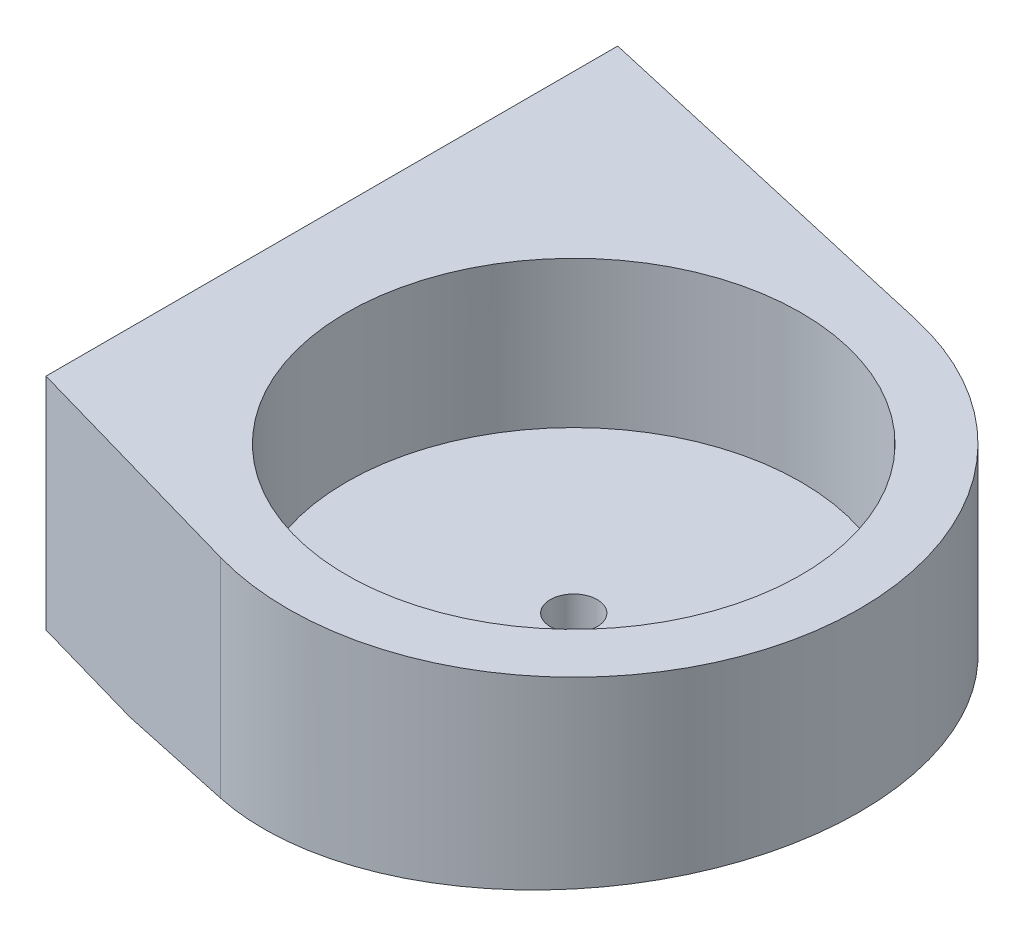
ISO-10303-21;
HEADER;
FILE_DESCRIPTION(('STEP AP214'),'2;1');
FILE_NAME('part.step','',(''),(''),'','','');
FILE_SCHEMA(('AUTOMOTIVE_DESIGN { 1 0 10303 214 1 1 1 1 }'));
ENDSEC;
DATA;
#1=APPLICATION_CONTEXT('core data for automotive mechanical design processes');
#2=APPLICATION_PROTOCOL_DEFINITION('international standard','automotive_design',2000,#1);
#3=PRODUCT_CONTEXT('',#1,'mechanical');
#4=PRODUCT('Part','Part','',(#3));
#5=PRODUCT_RELATED_PRODUCT_CATEGORY('part','',(#4));
#6=PRODUCT_DEFINITION_FORMATION('','',#4);
#7=PRODUCT_DEFINITION_CONTEXT('part definition',#1,'design');
#8=PRODUCT_DEFINITION('design','',#6,#7);
#9=PRODUCT_DEFINITION_SHAPE('','',#8);
#10=(LENGTH_UNIT() NAMED_UNIT(*) SI_UNIT(.MILLI.,.METRE.));
#11=(NAMED_UNIT(*) PLANE_ANGLE_UNIT() SI_UNIT($,.RADIAN.));
#12=(NAMED_UNIT(*) SI_UNIT($,.STERADIAN.) SOLID_ANGLE_UNIT());
#13=UNCERTAINTY_MEASURE_WITH_UNIT(LENGTH_MEASURE(1.E-05),#10,'distance_accuracy_value','');
#14=(GEOMETRIC_REPRESENTATION_CONTEXT(3) GLOBAL_UNCERTAINTY_ASSIGNED_CONTEXT((#13)) GLOBAL_UNIT_ASSIGNED_CONTEXT((#10,
#11,#12)) REPRESENTATION_CONTEXT('',''));
#15=CARTESIAN_POINT('',(0.,0.,0.));
#16=DIRECTION('',(0.,0.,1.));
#17=DIRECTION('',(1.,0.,0.));
#18=AXIS2_PLACEMENT_3D('',#15,#16,#17);
#19=CARTESIAN_POINT('',(4.32348319389158,15.,-19.0146652106246));
#20=DIRECTION('',(0.221717086866235,0.,-0.975111036442287));
#21=DIRECTION('',(-0.975111036442287,0.,-0.221717086866235));
#22=AXIS2_PLACEMENT_3D('',#19,#20,#21);
#23=PLANE('',#22);
#24=DIRECTION('',(0.,-1.,0.));
#25=VECTOR('',#24,1.);
#26=CARTESIAN_POINT('',(4.32348319389158,15.,-19.0146652106246));
#27=LINE('',#26,#25);
#28=CARTESIAN_POINT('',(4.32348319389158,15.,-19.0146652106246));
#29=VERTEX_POINT('',#28);
#30=CARTESIAN_POINT('',(4.32348319389158,1.64090894273656,-19.0146652106246));
#31=VERTEX_POINT('',#30);
#32=EDGE_CURVE('E78',#29,#31,#27,.T.);
#33=ORIENTED_EDGE('',*,*,#32,.T.);
#34=DIRECTION('',(-0.971414372160437,-0.086992331835263,-0.220876553219231));
#35=VECTOR('',#34,1.);
#36=CARTESIAN_POINT('',(5.4524012180103,1.7420060792248,-18.7579760682972));
#37=LINE('',#36,#35);
#38=CARTESIAN_POINT('',(-14.,0.,-23.1809900322722));
#39=VERTEX_POINT('',#38);
#40=EDGE_CURVE('E89',#31,#39,#37,.T.);
#41=ORIENTED_EDGE('',*,*,#40,.T.);
#42=DIRECTION('',(0.975111036442287,0.,0.221717086866235));
#43=VECTOR('',#42,1.);
#44=CARTESIAN_POINT('',(4.32348319389158,0.,-19.0146652106246));
#45=LINE('',#44,#43);
#46=CARTESIAN_POINT('',(-22.,0.,-25.));
#47=VERTEX_POINT('',#46);
#48=EDGE_CURVE('E93',#47,#39,#45,.T.);
#49=ORIENTED_EDGE('',*,*,#48,.F.);
#50=DIRECTION('',(0.,-1.,0.));
#51=VECTOR('',#50,1.);
#52=CARTESIAN_POINT('',(-22.,15.,-25.));
#53=LINE('',#52,#51);
#54=CARTESIAN_POINT('',(-22.,15.,-25.));
#55=VERTEX_POINT('',#54);
#56=EDGE_CURVE('E57',#55,#47,#53,.T.);
#57=ORIENTED_EDGE('',*,*,#56,.F.);
#58=DIRECTION('',(0.975111036442287,0.,0.221717086866235));
#59=VECTOR('',#58,1.);
#60=CARTESIAN_POINT('',(4.32348319389158,15.,-19.0146652106246));
#61=LINE('',#60,#59);
#62=EDGE_CURVE('E127',#55,#29,#61,.T.);
#63=ORIENTED_EDGE('',*,*,#62,.T.);
#64=EDGE_LOOP('',(#33,#41,#49,#57,#63));
#65=FACE_BOUND('',#64,.T.);
#66=ADVANCED_FACE('F34',(#65),#23,.T.);
#67=CARTESIAN_POINT('',(-5.3514292849436,15.,18.7513254093744));
#68=DIRECTION('',(-0.274432271022749,0.,0.961606431249966));
#69=DIRECTION('',(0.961606431249966,0.,0.274432271022749));
#70=AXIS2_PLACEMENT_3D('',#67,#68,#69);
#71=PLANE('',#70);
#72=DIRECTION('',(-0.961606431249966,0.,-0.274432271022749));
#73=VECTOR('',#72,1.);
#74=CARTESIAN_POINT('',(-5.3514292849436,0.,18.7513254093744));
#75=LINE('',#74,#73);
#76=CARTESIAN_POINT('',(-14.,0.,16.2831151049273));
#77=VERTEX_POINT('',#76);
#78=CARTESIAN_POINT('',(-22.,0.,14.));
#79=VERTEX_POINT('',#78);
#80=EDGE_CURVE('E97',#77,#79,#75,.T.);
#81=ORIENTED_EDGE('',*,*,#80,.F.);
#82=DIRECTION('',(0.958060684401584,0.0857964792001418,0.273420352499275));
#83=VECTOR('',#82,1.);
#84=CARTESIAN_POINT('',(-4.18211822024306,0.879213293709578,19.0850343786464));
#85=LINE('',#84,#83);
#86=CARTESIAN_POINT('',(-5.3514292849436,0.774498870005053,18.7513254093744));
#87=VERTEX_POINT('',#86);
#88=EDGE_CURVE('E48',#77,#87,#85,.T.);
#89=ORIENTED_EDGE('',*,*,#88,.T.);
#90=DIRECTION('',(0.,-1.,0.));
#91=VECTOR('',#90,1.);
#92=CARTESIAN_POINT('',(-5.3514292849436,15.,18.7513254093744));
#93=LINE('',#92,#91);
#94=CARTESIAN_POINT('',(-5.3514292849436,15.,18.7513254093744));
#95=VERTEX_POINT('',#94);
#96=EDGE_CURVE('E110',#95,#87,#93,.T.);
#97=ORIENTED_EDGE('',*,*,#96,.F.);
#98=DIRECTION('',(-0.961606431249966,0.,-0.274432271022749));
#99=VECTOR('',#98,1.);
#100=CARTESIAN_POINT('',(-5.3514292849436,15.,18.7513254093744));
#101=LINE('',#100,#99);
#102=CARTESIAN_POINT('',(-22.,15.,14.));
#103=VERTEX_POINT('',#102);
#104=EDGE_CURVE('E133',#95,#103,#101,.T.);
#105=ORIENTED_EDGE('',*,*,#104,.T.);
#106=DIRECTION('',(0.,-1.,0.));
#107=VECTOR('',#106,1.);
#108=CARTESIAN_POINT('',(-22.,15.,14.));
#109=LINE('',#108,#107);
#110=EDGE_CURVE('E107',#103,#79,#109,.T.);
#111=ORIENTED_EDGE('',*,*,#110,.T.);
#112=EDGE_LOOP('',(#81,#89,#97,#105,#111));
#113=FACE_BOUND('',#112,.T.);
#114=ADVANCED_FACE('F141',(#113),#71,.T.);
#115=CARTESIAN_POINT('',(0.,15.,0.));
#116=DIRECTION('',(0.,-1.,0.));
#117=DIRECTION('',(0.,0.,-1.));
#118=AXIS2_PLACEMENT_3D('',#115,#116,#117);
#119=CYLINDRICAL_SURFACE('',#118,19.5);
#120=ORIENTED_EDGE('',*,*,#96,.T.);
#121=CARTESIAN_POINT('',(0.,1.25373134328358,0.));
#122=DIRECTION('',(0.0891952975496599,-0.996014155971203,0.));
#123=DIRECTION('',(-0.996014155971203,-0.0891952975496599,0.));
#124=AXIS2_PLACEMENT_3D('',#121,#122,#123);
#125=ELLIPSE('',#124,19.5780349938759,19.5);
#126=EDGE_CURVE('E140',#87,#31,#125,.F.);
#127=ORIENTED_EDGE('',*,*,#126,.T.);
#128=ORIENTED_EDGE('',*,*,#32,.F.);
#129=CARTESIAN_POINT('',(0.,15.,0.));
#130=DIRECTION('',(0.,-1.,0.));
#131=DIRECTION('',(0.,0.,-1.));
#132=AXIS2_PLACEMENT_3D('',#129,#130,#131);
#133=CIRCLE('',#132,19.5);
#134=EDGE_CURVE('E129',#29,#95,#133,.T.);
#135=ORIENTED_EDGE('',*,*,#134,.T.);
#136=EDGE_LOOP('',(#120,#127,#128,#135));
#137=FACE_BOUND('',#136,.T.);
#138=ADVANCED_FACE('F139',(#137),#119,.T.);
#139=CARTESIAN_POINT('',(0.,0.,0.));
#140=DIRECTION('',(0.,1.,0.));
#141=DIRECTION('',(0.,0.,1.));
#142=AXIS2_PLACEMENT_3D('',#139,#140,#141);
#143=PLANE('',#142);
#144=CARTESIAN_POINT('',(-18.,0.,-5.5));
#145=DIRECTION('',(0.,-1.,0.));
#146=DIRECTION('',(0.,0.,-1.));
#147=AXIS2_PLACEMENT_3D('',#144,#145,#146);
#148=CIRCLE('',#147,2.05);
#149=CARTESIAN_POINT('',(-18.,0.,-7.55));
#150=VERTEX_POINT('',#149);
#151=EDGE_CURVE('E148',#150,#150,#148,.T.);
#152=ORIENTED_EDGE('',*,*,#151,.F.);
#153=EDGE_LOOP('',(#152));
#154=FACE_BOUND('',#153,.T.);
#155=DIRECTION('',(0.,0.,-1.));
#156=VECTOR('',#155,1.);
#157=CARTESIAN_POINT('',(-14.,0.,0.));
#158=LINE('',#157,#156);
#159=EDGE_CURVE('E11',#77,#39,#158,.T.);
#160=ORIENTED_EDGE('',*,*,#159,.F.);
#161=ORIENTED_EDGE('',*,*,#80,.T.);
#162=DIRECTION('',(0.,0.,-1.));
#163=VECTOR('',#162,1.);
#164=CARTESIAN_POINT('',(-22.,0.,0.));
#165=LINE('',#164,#163);
#166=EDGE_CURVE('E96',#79,#47,#165,.T.);
#167=ORIENTED_EDGE('',*,*,#166,.T.);
#168=ORIENTED_EDGE('',*,*,#48,.T.);
#169=EDGE_LOOP('',(#160,#161,#167,#168));
#170=FACE_BOUND('',#169,.T.);
#171=ADVANCED_FACE('F36',(#154,#170),#143,.F.);
#172=CARTESIAN_POINT('',(0.,5.,0.));
#173=DIRECTION('',(0.,1.,0.));
#174=DIRECTION('',(0.,0.,1.));
#175=AXIS2_PLACEMENT_3D('',#172,#173,#174);
#176=PLANE('',#175);
#177=CARTESIAN_POINT('',(0.,5.,0.));
#178=DIRECTION('',(0.,1.,0.));
#179=DIRECTION('',(0.,0.,1.));
#180=AXIS2_PLACEMENT_3D('',#177,#178,#179);
#181=CIRCLE('',#180,1.6);
#182=CARTESIAN_POINT('',(0.,5.,1.6));
#183=VERTEX_POINT('',#182);
#184=EDGE_CURVE('E142',#183,#183,#181,.T.);
#185=ORIENTED_EDGE('',*,*,#184,.F.);
#186=EDGE_LOOP('',(#185));
#187=FACE_BOUND('',#186,.T.);
#188=CARTESIAN_POINT('',(0.,5.,0.));
#189=DIRECTION('',(0.,1.,0.));
#190=DIRECTION('',(0.,0.,1.));
#191=AXIS2_PLACEMENT_3D('',#188,#189,#190);
#192=CIRCLE('',#191,15.5);
#193=CARTESIAN_POINT('',(0.,5.,15.5));
#194=VERTEX_POINT('',#193);
#195=EDGE_CURVE('E42',#194,#194,#192,.T.);
#196=ORIENTED_EDGE('',*,*,#195,.T.);
#197=EDGE_LOOP('',(#196));
#198=FACE_BOUND('',#197,.T.);
#199=ADVANCED_FACE('F116',(#187,#198),#176,.T.);
#200=CARTESIAN_POINT('',(-22.,15.,0.));
#201=DIRECTION('',(-1.,0.,0.));
#202=DIRECTION('',(0.,0.,1.));
#203=AXIS2_PLACEMENT_3D('',#200,#201,#202);
#204=PLANE('',#203);
#205=ORIENTED_EDGE('',*,*,#166,.F.);
#206=ORIENTED_EDGE('',*,*,#110,.F.);
#207=DIRECTION('',(0.,0.,-1.));
#208=VECTOR('',#207,1.);
#209=CARTESIAN_POINT('',(-22.,15.,0.));
#210=LINE('',#209,#208);
#211=EDGE_CURVE('E101',#103,#55,#210,.T.);
#212=ORIENTED_EDGE('',*,*,#211,.T.);
#213=ORIENTED_EDGE('',*,*,#56,.T.);
#214=EDGE_LOOP('',(#205,#206,#212,#213));
#215=FACE_BOUND('',#214,.T.);
#216=ADVANCED_FACE('F122',(#215),#204,.T.);
#217=CARTESIAN_POINT('',(0.,15.,0.));
#218=DIRECTION('',(0.,-1.,0.));
#219=DIRECTION('',(0.,0.,-1.));
#220=AXIS2_PLACEMENT_3D('',#217,#218,#219);
#221=CYLINDRICAL_SURFACE('',#220,15.5);
#222=ORIENTED_EDGE('',*,*,#195,.F.);
#223=EDGE_LOOP('',(#222));
#224=FACE_BOUND('',#223,.T.);
#225=CARTESIAN_POINT('',(0.,15.,0.));
#226=DIRECTION('',(0.,-1.,0.));
#227=DIRECTION('',(0.,0.,-1.));
#228=AXIS2_PLACEMENT_3D('',#225,#226,#227);
#229=CIRCLE('',#228,15.5);
#230=CARTESIAN_POINT('',(0.,15.,-15.5));
#231=VERTEX_POINT('',#230);
#232=EDGE_CURVE('E105',#231,#231,#229,.T.);
#233=ORIENTED_EDGE('',*,*,#232,.F.);
#234=EDGE_LOOP('',(#233));
#235=FACE_BOUND('',#234,.T.);
#236=ADVANCED_FACE('F118',(#224,#235),#221,.F.);
#237=CARTESIAN_POINT('',(0.,15.,0.));
#238=DIRECTION('',(0.,-1.,0.));
#239=DIRECTION('',(0.,0.,-1.));
#240=AXIS2_PLACEMENT_3D('',#237,#238,#239);
#241=PLANE('',#240);
#242=ORIENTED_EDGE('',*,*,#232,.T.);
#243=EDGE_LOOP('',(#242));
#244=FACE_BOUND('',#243,.T.);
#245=ORIENTED_EDGE('',*,*,#62,.F.);
#246=ORIENTED_EDGE('',*,*,#211,.F.);
#247=ORIENTED_EDGE('',*,*,#104,.F.);
#248=ORIENTED_EDGE('',*,*,#134,.F.);
#249=EDGE_LOOP('',(#245,#246,#247,#248));
#250=FACE_BOUND('',#249,.T.);
#251=ADVANCED_FACE('F121',(#244,#250),#241,.F.);
#252=CARTESIAN_POINT('',(-0.111381215469613,1.24375690607735,-24.));
#253=DIRECTION('',(0.0891952975496599,-0.996014155971203,0.));
#254=DIRECTION('',(0.996014155971203,0.0891952975496599,0.));
#255=AXIS2_PLACEMENT_3D('',#252,#253,#254);
#256=PLANE('',#255);
#257=CARTESIAN_POINT('',(0.,1.25373134328358,0.));
#258=DIRECTION('',(0.0891952975496599,-0.996014155971203,0.));
#259=DIRECTION('',(0.996014155971203,0.0891952975496599,0.));
#260=AXIS2_PLACEMENT_3D('',#257,#258,#259);
#261=ELLIPSE('',#260,4.01600717823096,4.);
#262=CARTESIAN_POINT('',(4.,1.61194029850746,0.));
#263=VERTEX_POINT('',#262);
#264=EDGE_CURVE('E154',#263,#263,#261,.F.);
#265=ORIENTED_EDGE('',*,*,#264,.T.);
#266=EDGE_LOOP('',(#265));
#267=FACE_BOUND('',#266,.T.);
#268=ORIENTED_EDGE('',*,*,#126,.F.);
#269=ORIENTED_EDGE('',*,*,#88,.F.);
#270=ORIENTED_EDGE('',*,*,#159,.T.);
#271=ORIENTED_EDGE('',*,*,#40,.F.);
#272=EDGE_LOOP('',(#268,#269,#270,#271));
#273=FACE_BOUND('',#272,.T.);
#274=ADVANCED_FACE('F88',(#267,#273),#256,.T.);
#275=CARTESIAN_POINT('',(0.,0.,0.));
#276=DIRECTION('',(0.,1.,0.));
#277=DIRECTION('',(0.,0.,1.));
#278=AXIS2_PLACEMENT_3D('',#275,#276,#277);
#279=CYLINDRICAL_SURFACE('',#278,1.6);
#280=CARTESIAN_POINT('',(0.,2.,0.));
#281=DIRECTION('',(0.,1.,0.));
#282=DIRECTION('',(0.,0.,1.));
#283=AXIS2_PLACEMENT_3D('',#280,#281,#282);
#284=CIRCLE('',#283,1.6);
#285=CARTESIAN_POINT('',(0.,2.,1.6));
#286=VERTEX_POINT('',#285);
#287=EDGE_CURVE('E151',#286,#286,#284,.T.);
#288=ORIENTED_EDGE('',*,*,#287,.F.);
#289=EDGE_LOOP('',(#288));
#290=FACE_BOUND('',#289,.T.);
#291=ORIENTED_EDGE('',*,*,#184,.T.);
#292=EDGE_LOOP('',(#291));
#293=FACE_BOUND('',#292,.T.);
#294=ADVANCED_FACE('F192',(#290,#293),#279,.F.);
#295=CARTESIAN_POINT('',(-18.,6.,-5.5));
#296=DIRECTION('',(0.,-1.,0.));
#297=DIRECTION('',(0.,0.,-1.));
#298=AXIS2_PLACEMENT_3D('',#295,#296,#297);
#299=CYLINDRICAL_SURFACE('',#298,2.05);
#300=CARTESIAN_POINT('',(-18.,6.,-5.5));
#301=DIRECTION('',(0.,-1.,0.));
#302=DIRECTION('',(0.,0.,-1.));
#303=AXIS2_PLACEMENT_3D('',#300,#301,#302);
#304=CIRCLE('',#303,2.05);
#305=CARTESIAN_POINT('',(-18.,6.,-7.55));
#306=VERTEX_POINT('',#305);
#307=EDGE_CURVE('E147',#306,#306,#304,.T.);
#308=ORIENTED_EDGE('',*,*,#307,.F.);
#309=EDGE_LOOP('',(#308));
#310=FACE_BOUND('',#309,.T.);
#311=ORIENTED_EDGE('',*,*,#151,.T.);
#312=EDGE_LOOP('',(#311));
#313=FACE_BOUND('',#312,.T.);
#314=ADVANCED_FACE('F194',(#310,#313),#299,.F.);
#315=CARTESIAN_POINT('',(-18.,6.,-5.5));
#316=DIRECTION('',(0.,-1.,0.));
#317=DIRECTION('',(0.,0.,-1.));
#318=AXIS2_PLACEMENT_3D('',#315,#316,#317);
#319=PLANE('',#318);
#320=ORIENTED_EDGE('',*,*,#307,.T.);
#321=EDGE_LOOP('',(#320));
#322=FACE_BOUND('',#321,.T.);
#323=ADVANCED_FACE('F172',(#322),#319,.T.);
#324=CARTESIAN_POINT('',(0.,-0.00100000000000013,0.));
#325=DIRECTION('',(0.,1.,0.));
#326=DIRECTION('',(0.,0.,1.));
#327=AXIS2_PLACEMENT_3D('',#324,#325,#326);
#328=CYLINDRICAL_SURFACE('',#327,4.);
#329=ORIENTED_EDGE('',*,*,#264,.F.);
#330=EDGE_LOOP('',(#329));
#331=FACE_BOUND('',#330,.T.);
#332=CARTESIAN_POINT('',(0.,2.,0.));
#333=DIRECTION('',(0.,1.,0.));
#334=DIRECTION('',(0.,0.,1.));
#335=AXIS2_PLACEMENT_3D('',#332,#333,#334);
#336=CIRCLE('',#335,4.);
#337=CARTESIAN_POINT('',(0.,2.,4.));
#338=VERTEX_POINT('',#337);
#339=EDGE_CURVE('E157',#338,#338,#336,.T.);
#340=ORIENTED_EDGE('',*,*,#339,.T.);
#341=EDGE_LOOP('',(#340));
#342=FACE_BOUND('',#341,.T.);
#343=ADVANCED_FACE('F163',(#331,#342),#328,.F.);
#344=CARTESIAN_POINT('',(0.,2.,0.));
#345=DIRECTION('',(0.,1.,0.));
#346=DIRECTION('',(0.,0.,1.));
#347=AXIS2_PLACEMENT_3D('',#344,#345,#346);
#348=PLANE('',#347);
#349=ORIENTED_EDGE('',*,*,#287,.T.);
#350=EDGE_LOOP('',(#349));
#351=FACE_BOUND('',#350,.T.);
#352=ORIENTED_EDGE('',*,*,#339,.F.);
#353=EDGE_LOOP('',(#352));
#354=FACE_BOUND('',#353,.T.);
#355=ADVANCED_FACE('F165',(#351,#354),#348,.F.);
#356=CLOSED_SHELL('',(#66,#114,#138,#171,#199,#216,#236,#251,#274,#294,#314,#323,#343,#355));
#357=MANIFOLD_SOLID_BREP('B2',#356);
#358=ADVANCED_BREP_SHAPE_REPRESENTATION('',(#18,#357),#14);
#359=SHAPE_DEFINITION_REPRESENTATION(#9,#358);
ENDSEC;
END-ISO-10303-21;
